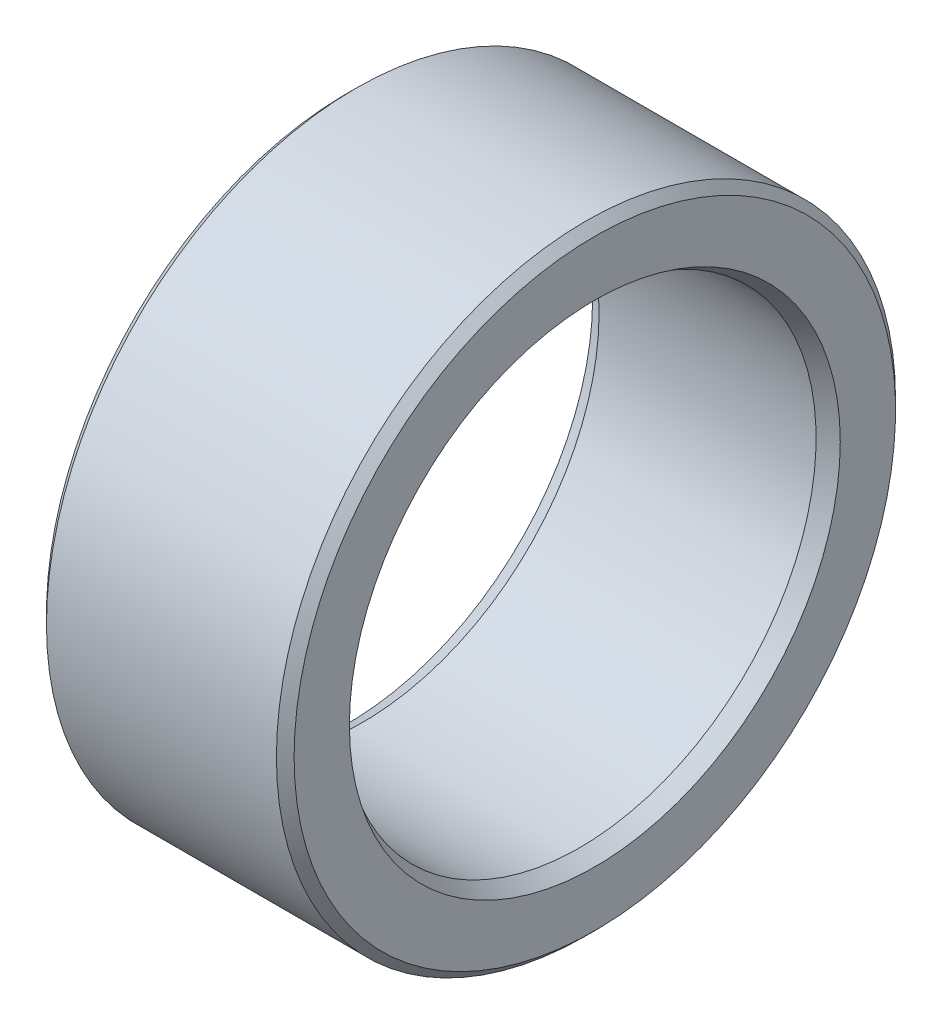
ISO-10303-21;
HEADER;
FILE_DESCRIPTION(('STEP AP214'),'2;1');
FILE_NAME('part.step','',(''),(''),'','','');
FILE_SCHEMA(('AUTOMOTIVE_DESIGN { 1 0 10303 214 1 1 1 1 }'));
ENDSEC;
DATA;
#1=APPLICATION_CONTEXT('core data for automotive mechanical design processes');
#2=APPLICATION_PROTOCOL_DEFINITION('international standard','automotive_design',2000,#1);
#3=PRODUCT_CONTEXT('',#1,'mechanical');
#4=PRODUCT('Part','Part','',(#3));
#5=PRODUCT_RELATED_PRODUCT_CATEGORY('part','',(#4));
#6=PRODUCT_DEFINITION_FORMATION('','',#4);
#7=PRODUCT_DEFINITION_CONTEXT('part definition',#1,'design');
#8=PRODUCT_DEFINITION('design','',#6,#7);
#9=PRODUCT_DEFINITION_SHAPE('','',#8);
#10=(LENGTH_UNIT() NAMED_UNIT(*) SI_UNIT(.MILLI.,.METRE.));
#11=(NAMED_UNIT(*) PLANE_ANGLE_UNIT() SI_UNIT($,.RADIAN.));
#12=(NAMED_UNIT(*) SI_UNIT($,.STERADIAN.) SOLID_ANGLE_UNIT());
#13=UNCERTAINTY_MEASURE_WITH_UNIT(LENGTH_MEASURE(1.E-05),#10,'distance_accuracy_value','');
#14=(GEOMETRIC_REPRESENTATION_CONTEXT(3) GLOBAL_UNCERTAINTY_ASSIGNED_CONTEXT((#13)) GLOBAL_UNIT_ASSIGNED_CONTEXT((#10,
#11,#12)) REPRESENTATION_CONTEXT('',''));
#15=CARTESIAN_POINT('',(0.,0.,0.));
#16=DIRECTION('',(0.,0.,1.));
#17=DIRECTION('',(1.,0.,0.));
#18=AXIS2_PLACEMENT_3D('',#15,#16,#17);
#19=CARTESIAN_POINT('',(-14.2086792757855,24.7637305349022,-2.83385088727073));
#20=DIRECTION('',(-1.,0.,0.));
#21=DIRECTION('',(0.,0.,1.));
#22=AXIS2_PLACEMENT_3D('',#19,#20,#21);
#23=PLANE('',#22);
#24=CARTESIAN_POINT('',(-14.2086792757855,17.9692305349022,-2.83385088727073));
#25=DIRECTION('',(-1.,0.,0.));
#26=DIRECTION('',(0.,0.,1.));
#27=AXIS2_PLACEMENT_3D('',#24,#25,#26);
#28=CIRCLE('',#27,7.04850000000001);
#29=CARTESIAN_POINT('',(-14.2086792757855,17.9692305349022,4.21464911272928));
#30=VERTEX_POINT('',#29);
#31=EDGE_CURVE('E29',#30,#30,#28,.T.);
#32=ORIENTED_EDGE('',*,*,#31,.T.);
#33=EDGE_LOOP('',(#32));
#34=FACE_BOUND('',#33,.T.);
#35=CARTESIAN_POINT('',(-14.2086792757855,17.9692305349022,-2.83385088727073));
#36=DIRECTION('',(-1.,0.,0.));
#37=DIRECTION('',(0.,0.,1.));
#38=AXIS2_PLACEMENT_3D('',#35,#36,#37);
#39=CIRCLE('',#38,8.636);
#40=CARTESIAN_POINT('',(-14.2086792757855,17.9692305349022,5.80214911272927));
#41=VERTEX_POINT('',#40);
#42=EDGE_CURVE('E37',#41,#41,#39,.F.);
#43=ORIENTED_EDGE('',*,*,#42,.T.);
#44=EDGE_LOOP('',(#43));
#45=FACE_BOUND('',#44,.T.);
#46=ADVANCED_FACE('F14',(#34,#45),#23,.F.);
#47=CARTESIAN_POINT('',(-22.8633705613592,17.9692305349022,-2.83385088727073));
#48=DIRECTION('',(-1.,0.,0.));
#49=DIRECTION('',(0.,0.,1.));
#50=AXIS2_PLACEMENT_3D('',#47,#48,#49);
#51=CYLINDRICAL_SURFACE('',#50,8.89);
#52=CARTESIAN_POINT('',(-14.4626792757855,17.9692305349022,-2.83385088727073));
#53=DIRECTION('',(-1.,0.,0.));
#54=DIRECTION('',(0.,0.,1.));
#55=AXIS2_PLACEMENT_3D('',#52,#53,#54);
#56=CIRCLE('',#55,8.89);
#57=CARTESIAN_POINT('',(-14.4626792757855,17.9692305349022,6.05614911272927));
#58=VERTEX_POINT('',#57);
#59=EDGE_CURVE('E40',#58,#58,#56,.T.);
#60=ORIENTED_EDGE('',*,*,#59,.T.);
#61=EDGE_LOOP('',(#60));
#62=FACE_BOUND('',#61,.T.);
#63=CARTESIAN_POINT('',(-21.0666792757855,17.9692305349022,-2.83385088727073));
#64=DIRECTION('',(1.,0.,0.));
#65=DIRECTION('',(0.,0.,-1.));
#66=AXIS2_PLACEMENT_3D('',#63,#64,#65);
#67=CIRCLE('',#66,8.89);
#68=CARTESIAN_POINT('',(-21.0666792757855,17.9692305349022,-11.7238508872707));
#69=VERTEX_POINT('',#68);
#70=EDGE_CURVE('E43',#69,#69,#67,.T.);
#71=ORIENTED_EDGE('',*,*,#70,.T.);
#72=EDGE_LOOP('',(#71));
#73=FACE_BOUND('',#72,.T.);
#74=ADVANCED_FACE('F47',(#62,#73),#51,.T.);
#75=CARTESIAN_POINT('',(-21.3206792757855,26.8592305349022,-2.83385088727073));
#76=DIRECTION('',(1.,0.,0.));
#77=DIRECTION('',(0.,0.,-1.));
#78=AXIS2_PLACEMENT_3D('',#75,#76,#77);
#79=PLANE('',#78);
#80=CARTESIAN_POINT('',(-21.3206792757855,17.9692305349022,-2.83385088727073));
#81=DIRECTION('',(1.,0.,0.));
#82=DIRECTION('',(0.,0.,-1.));
#83=AXIS2_PLACEMENT_3D('',#80,#81,#82);
#84=CIRCLE('',#83,7.04850000000001);
#85=CARTESIAN_POINT('',(-21.3206792757855,17.9692305349022,-9.88235088727074));
#86=VERTEX_POINT('',#85);
#87=EDGE_CURVE('E10',#86,#86,#84,.T.);
#88=ORIENTED_EDGE('',*,*,#87,.T.);
#89=EDGE_LOOP('',(#88));
#90=FACE_BOUND('',#89,.T.);
#91=CARTESIAN_POINT('',(-21.3206792757855,17.9692305349022,-2.83385088727073));
#92=DIRECTION('',(1.,0.,0.));
#93=DIRECTION('',(0.,0.,-1.));
#94=AXIS2_PLACEMENT_3D('',#91,#92,#93);
#95=CIRCLE('',#94,8.63599999999999);
#96=CARTESIAN_POINT('',(-21.3206792757855,17.9692305349022,-11.4698508872707));
#97=VERTEX_POINT('',#96);
#98=EDGE_CURVE('E34',#97,#97,#95,.F.);
#99=ORIENTED_EDGE('',*,*,#98,.T.);
#100=EDGE_LOOP('',(#99));
#101=FACE_BOUND('',#100,.T.);
#102=ADVANCED_FACE('F57',(#90,#101),#79,.F.);
#103=CARTESIAN_POINT('',(-22.8633705613592,17.9692305349022,-2.83385088727073));
#104=DIRECTION('',(-1.,0.,0.));
#105=DIRECTION('',(0.,0.,1.));
#106=AXIS2_PLACEMENT_3D('',#103,#104,#105);
#107=CYLINDRICAL_SURFACE('',#106,6.7945);
#108=CARTESIAN_POINT('',(-14.648620180908,17.9692305349022,-2.83385088727073));
#109=DIRECTION('',(-1.,0.,0.));
#110=DIRECTION('',(0.,0.,1.));
#111=AXIS2_PLACEMENT_3D('',#108,#109,#110);
#112=CIRCLE('',#111,6.7945);
#113=CARTESIAN_POINT('',(-14.648620180908,17.9692305349022,3.96064911272927));
#114=VERTEX_POINT('',#113);
#115=EDGE_CURVE('E21',#114,#114,#112,.F.);
#116=ORIENTED_EDGE('',*,*,#115,.T.);
#117=EDGE_LOOP('',(#116));
#118=FACE_BOUND('',#117,.T.);
#119=CARTESIAN_POINT('',(-20.880738370663,17.9692305349022,-2.83385088727073));
#120=DIRECTION('',(1.,0.,0.));
#121=DIRECTION('',(0.,0.,-1.));
#122=AXIS2_PLACEMENT_3D('',#119,#120,#121);
#123=CIRCLE('',#122,6.7945);
#124=CARTESIAN_POINT('',(-20.880738370663,17.9692305349022,-9.62835088727073));
#125=VERTEX_POINT('',#124);
#126=EDGE_CURVE('E25',#125,#125,#123,.F.);
#127=ORIENTED_EDGE('',*,*,#126,.T.);
#128=EDGE_LOOP('',(#127));
#129=FACE_BOUND('',#128,.T.);
#130=ADVANCED_FACE('F59',(#118,#129),#107,.F.);
#131=CARTESIAN_POINT('',(-14.4626792757855,17.9692305349022,-2.83385088727073));
#132=DIRECTION('',(-1.,0.,0.));
#133=DIRECTION('',(0.,0.,1.));
#134=AXIS2_PLACEMENT_3D('',#131,#132,#133);
#135=CONICAL_SURFACE('',#134,8.89,0.785398163397455);
#136=ORIENTED_EDGE('',*,*,#42,.F.);
#137=EDGE_LOOP('',(#136));
#138=FACE_BOUND('',#137,.T.);
#139=ORIENTED_EDGE('',*,*,#59,.F.);
#140=EDGE_LOOP('',(#139));
#141=FACE_BOUND('',#140,.T.);
#142=ADVANCED_FACE('F53',(#138,#141),#135,.T.);
#143=CARTESIAN_POINT('',(-21.3206792757855,17.9692305349022,-2.83385088727073));
#144=DIRECTION('',(1.,0.,0.));
#145=DIRECTION('',(0.,0.,-1.));
#146=AXIS2_PLACEMENT_3D('',#143,#144,#145);
#147=CONICAL_SURFACE('',#146,8.63599999999999,0.785398163397445);
#148=ORIENTED_EDGE('',*,*,#70,.F.);
#149=EDGE_LOOP('',(#148));
#150=FACE_BOUND('',#149,.T.);
#151=ORIENTED_EDGE('',*,*,#98,.F.);
#152=EDGE_LOOP('',(#151));
#153=FACE_BOUND('',#152,.T.);
#154=ADVANCED_FACE('F49',(#150,#153),#147,.T.);
#155=CARTESIAN_POINT('',(-14.2086792757855,17.9692305349022,-2.83385088727073));
#156=DIRECTION('',(1.,0.,0.));
#157=DIRECTION('',(0.,0.,-1.));
#158=AXIS2_PLACEMENT_3D('',#155,#156,#157);
#159=CONICAL_SURFACE('',#158,7.04850000000001,0.523598775598304);
#160=ORIENTED_EDGE('',*,*,#115,.F.);
#161=EDGE_LOOP('',(#160));
#162=FACE_BOUND('',#161,.T.);
#163=ORIENTED_EDGE('',*,*,#31,.F.);
#164=EDGE_LOOP('',(#163));
#165=FACE_BOUND('',#164,.T.);
#166=ADVANCED_FACE('F52',(#162,#165),#159,.F.);
#167=CARTESIAN_POINT('',(-20.880738370663,17.9692305349022,-2.83385088727073));
#168=DIRECTION('',(-1.,0.,0.));
#169=DIRECTION('',(0.,0.,1.));
#170=AXIS2_PLACEMENT_3D('',#167,#168,#169);
#171=CONICAL_SURFACE('',#170,6.7945,0.523598775598297);
#172=ORIENTED_EDGE('',*,*,#87,.F.);
#173=EDGE_LOOP('',(#172));
#174=FACE_BOUND('',#173,.T.);
#175=ORIENTED_EDGE('',*,*,#126,.F.);
#176=EDGE_LOOP('',(#175));
#177=FACE_BOUND('',#176,.T.);
#178=ADVANCED_FACE('F16',(#174,#177),#171,.F.);
#179=CLOSED_SHELL('',(#46,#74,#102,#130,#142,#154,#166,#178));
#180=MANIFOLD_SOLID_BREP('B1',#179);
#181=ADVANCED_BREP_SHAPE_REPRESENTATION('',(#18,#180),#14);
#182=SHAPE_DEFINITION_REPRESENTATION(#9,#181);
ENDSEC;
END-ISO-10303-21;
